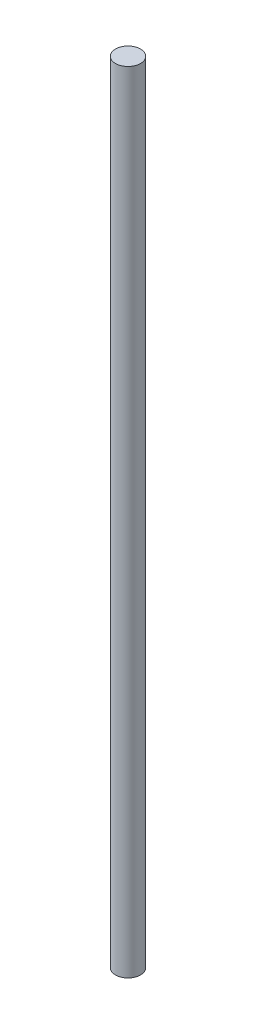
ISO-10303-21;
HEADER;
FILE_DESCRIPTION(('STEP AP214'),'2;1');
FILE_NAME('part.step','',(''),(''),'','','');
FILE_SCHEMA(('AUTOMOTIVE_DESIGN { 1 0 10303 214 1 1 1 1 }'));
ENDSEC;
DATA;
#1=APPLICATION_CONTEXT('core data for automotive mechanical design processes');
#2=APPLICATION_PROTOCOL_DEFINITION('international standard','automotive_design',2000,#1);
#3=PRODUCT_CONTEXT('',#1,'mechanical');
#4=PRODUCT('Part','Part','',(#3));
#5=PRODUCT_RELATED_PRODUCT_CATEGORY('part','',(#4));
#6=PRODUCT_DEFINITION_FORMATION('','',#4);
#7=PRODUCT_DEFINITION_CONTEXT('part definition',#1,'design');
#8=PRODUCT_DEFINITION('design','',#6,#7);
#9=PRODUCT_DEFINITION_SHAPE('','',#8);
#10=(LENGTH_UNIT() NAMED_UNIT(*) SI_UNIT(.MILLI.,.METRE.));
#11=(NAMED_UNIT(*) PLANE_ANGLE_UNIT() SI_UNIT($,.RADIAN.));
#12=(NAMED_UNIT(*) SI_UNIT($,.STERADIAN.) SOLID_ANGLE_UNIT());
#13=UNCERTAINTY_MEASURE_WITH_UNIT(LENGTH_MEASURE(1.E-05),#10,'distance_accuracy_value','');
#14=(GEOMETRIC_REPRESENTATION_CONTEXT(3) GLOBAL_UNCERTAINTY_ASSIGNED_CONTEXT((#13)) GLOBAL_UNIT_ASSIGNED_CONTEXT((#10,
#11,#12)) REPRESENTATION_CONTEXT('',''));
#15=CARTESIAN_POINT('',(0.,0.,0.));
#16=DIRECTION('',(0.,0.,1.));
#17=DIRECTION('',(1.,0.,0.));
#18=AXIS2_PLACEMENT_3D('',#15,#16,#17);
#19=CARTESIAN_POINT('',(0.,200.025,0.));
#20=DIRECTION('',(0.,-1.,0.));
#21=DIRECTION('',(0.,0.,-1.));
#22=AXIS2_PLACEMENT_3D('',#19,#20,#21);
#23=CYLINDRICAL_SURFACE('',#22,3.175);
#24=CARTESIAN_POINT('',(0.,200.025,0.));
#25=DIRECTION('',(0.,1.,0.));
#26=DIRECTION('',(0.,0.,1.));
#27=AXIS2_PLACEMENT_3D('',#24,#25,#26);
#28=CIRCLE('',#27,3.175);
#29=CARTESIAN_POINT('',(0.,200.025,3.175));
#30=VERTEX_POINT('',#29);
#31=EDGE_CURVE('E11',#30,#30,#28,.T.);
#32=ORIENTED_EDGE('',*,*,#31,.F.);
#33=EDGE_LOOP('',(#32));
#34=FACE_BOUND('',#33,.T.);
#35=CARTESIAN_POINT('',(0.,0.,0.));
#36=DIRECTION('',(0.,1.,0.));
#37=DIRECTION('',(0.,0.,1.));
#38=AXIS2_PLACEMENT_3D('',#35,#36,#37);
#39=CIRCLE('',#38,3.175);
#40=CARTESIAN_POINT('',(0.,0.,3.175));
#41=VERTEX_POINT('',#40);
#42=EDGE_CURVE('E36',#41,#41,#39,.T.);
#43=ORIENTED_EDGE('',*,*,#42,.T.);
#44=EDGE_LOOP('',(#43));
#45=FACE_BOUND('',#44,.T.);
#46=ADVANCED_FACE('F33',(#34,#45),#23,.T.);
#47=CARTESIAN_POINT('',(0.,200.025,0.));
#48=DIRECTION('',(0.,1.,0.));
#49=DIRECTION('',(0.,0.,1.));
#50=AXIS2_PLACEMENT_3D('',#47,#48,#49);
#51=PLANE('',#50);
#52=ORIENTED_EDGE('',*,*,#31,.T.);
#53=EDGE_LOOP('',(#52));
#54=FACE_BOUND('',#53,.T.);
#55=ADVANCED_FACE('F62',(#54),#51,.T.);
#56=CARTESIAN_POINT('',(0.,0.,0.));
#57=DIRECTION('',(0.,1.,0.));
#58=DIRECTION('',(0.,0.,1.));
#59=AXIS2_PLACEMENT_3D('',#56,#57,#58);
#60=PLANE('',#59);
#61=CARTESIAN_POINT('',(0.,0.,0.));
#62=DIRECTION('',(0.,-1.,0.));
#63=DIRECTION('',(0.,0.,-1.));
#64=AXIS2_PLACEMENT_3D('',#61,#62,#63);
#65=CIRCLE('',#64,1.47319999999999);
#66=CARTESIAN_POINT('',(0.,0.,-1.47319999999999));
#67=VERTEX_POINT('',#66);
#68=EDGE_CURVE('E52',#67,#67,#65,.T.);
#69=ORIENTED_EDGE('',*,*,#68,.F.);
#70=EDGE_LOOP('',(#69));
#71=FACE_BOUND('',#70,.T.);
#72=ORIENTED_EDGE('',*,*,#42,.F.);
#73=EDGE_LOOP('',(#72));
#74=FACE_BOUND('',#73,.T.);
#75=ADVANCED_FACE('F46',(#71,#74),#60,.F.);
#76=CARTESIAN_POINT('',(0.,3.6576,0.));
#77=DIRECTION('',(0.,-1.,0.));
#78=DIRECTION('',(0.,0.,-1.));
#79=AXIS2_PLACEMENT_3D('',#76,#77,#78);
#80=CONICAL_SURFACE('',#79,1.4732,1.02974425867665);
#81=CARTESIAN_POINT('',(0.,4.5427878639514,0.));
#82=VERTEX_POINT('',#81);
#83=VERTEX_LOOP('',#82);
#84=FACE_BOUND('',#83,.T.);
#85=CARTESIAN_POINT('',(0.,3.6576,0.));
#86=DIRECTION('',(0.,-1.,0.));
#87=DIRECTION('',(0.,0.,-1.));
#88=AXIS2_PLACEMENT_3D('',#85,#86,#87);
#89=CIRCLE('',#88,1.4732);
#90=CARTESIAN_POINT('',(0.,3.6576,-1.4732));
#91=VERTEX_POINT('',#90);
#92=EDGE_CURVE('E50',#91,#91,#89,.T.);
#93=ORIENTED_EDGE('',*,*,#92,.T.);
#94=EDGE_LOOP('',(#93));
#95=FACE_BOUND('',#94,.T.);
#96=ADVANCED_FACE('F42',(#84,#95),#80,.F.);
#97=CARTESIAN_POINT('',(0.,0.,0.));
#98=DIRECTION('',(0.,-1.,0.));
#99=DIRECTION('',(0.,0.,-1.));
#100=AXIS2_PLACEMENT_3D('',#97,#98,#99);
#101=CYLINDRICAL_SURFACE('',#100,1.47319999999999);
#102=ORIENTED_EDGE('',*,*,#92,.F.);
#103=EDGE_LOOP('',(#102));
#104=FACE_BOUND('',#103,.T.);
#105=ORIENTED_EDGE('',*,*,#68,.T.);
#106=EDGE_LOOP('',(#105));
#107=FACE_BOUND('',#106,.T.);
#108=ADVANCED_FACE('F45',(#104,#107),#101,.F.);
#109=CLOSED_SHELL('',(#46,#55,#75,#96,#108));
#110=MANIFOLD_SOLID_BREP('B2',#109);
#111=ADVANCED_BREP_SHAPE_REPRESENTATION('',(#18,#110),#14);
#112=SHAPE_DEFINITION_REPRESENTATION(#9,#111);
ENDSEC;
END-ISO-10303-21;
